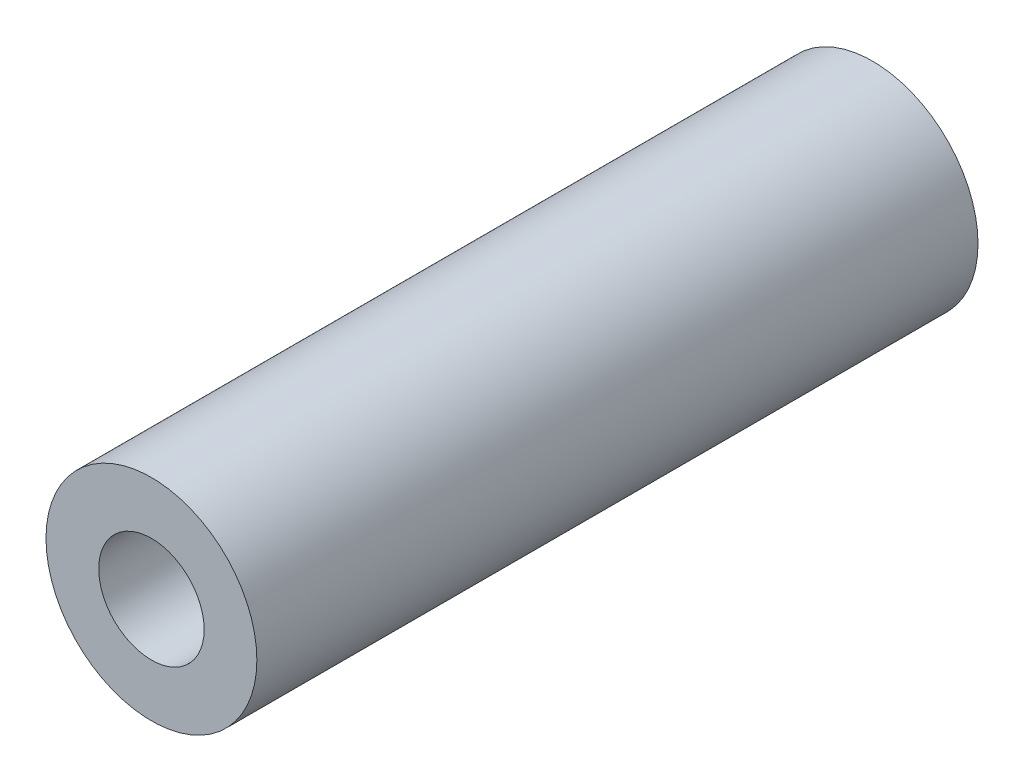
ISO-10303-21;
HEADER;
FILE_DESCRIPTION(('STEP AP214'),'2;1');
FILE_NAME('part.step','',(''),(''),'','','');
FILE_SCHEMA(('AUTOMOTIVE_DESIGN { 1 0 10303 214 1 1 1 1 }'));
ENDSEC;
DATA;
#1=APPLICATION_CONTEXT('core data for automotive mechanical design processes');
#2=APPLICATION_PROTOCOL_DEFINITION('international standard','automotive_design',2000,#1);
#3=PRODUCT_CONTEXT('',#1,'mechanical');
#4=PRODUCT('Part','Part','',(#3));
#5=PRODUCT_RELATED_PRODUCT_CATEGORY('part','',(#4));
#6=PRODUCT_DEFINITION_FORMATION('','',#4);
#7=PRODUCT_DEFINITION_CONTEXT('part definition',#1,'design');
#8=PRODUCT_DEFINITION('design','',#6,#7);
#9=PRODUCT_DEFINITION_SHAPE('','',#8);
#10=(LENGTH_UNIT() NAMED_UNIT(*) SI_UNIT(.MILLI.,.METRE.));
#11=(NAMED_UNIT(*) PLANE_ANGLE_UNIT() SI_UNIT($,.RADIAN.));
#12=(NAMED_UNIT(*) SI_UNIT($,.STERADIAN.) SOLID_ANGLE_UNIT());
#13=UNCERTAINTY_MEASURE_WITH_UNIT(LENGTH_MEASURE(1.E-05),#10,'distance_accuracy_value','');
#14=(GEOMETRIC_REPRESENTATION_CONTEXT(3) GLOBAL_UNCERTAINTY_ASSIGNED_CONTEXT((#13)) GLOBAL_UNIT_ASSIGNED_CONTEXT((#10,
#11,#12)) REPRESENTATION_CONTEXT('',''));
#15=CARTESIAN_POINT('',(0.,0.,0.));
#16=DIRECTION('',(0.,0.,1.));
#17=DIRECTION('',(1.,0.,0.));
#18=AXIS2_PLACEMENT_3D('',#15,#16,#17);
#19=CARTESIAN_POINT('',(0.,0.,43.434));
#20=DIRECTION('',(0.,0.,1.));
#21=DIRECTION('',(1.,0.,0.));
#22=AXIS2_PLACEMENT_3D('',#19,#20,#21);
#23=PLANE('',#22);
#24=CARTESIAN_POINT('',(0.,0.,43.434));
#25=DIRECTION('',(0.,0.,1.));
#26=DIRECTION('',(1.,0.,0.));
#27=AXIS2_PLACEMENT_3D('',#24,#25,#26);
#28=CIRCLE('',#27,6.35);
#29=CARTESIAN_POINT('',(6.35,0.,43.434));
#30=VERTEX_POINT('',#29);
#31=EDGE_CURVE('E10',#30,#30,#28,.T.);
#32=ORIENTED_EDGE('',*,*,#31,.T.);
#33=EDGE_LOOP('',(#32));
#34=FACE_BOUND('',#33,.T.);
#35=CARTESIAN_POINT('',(0.,0.,43.434));
#36=DIRECTION('',(0.,0.,1.));
#37=DIRECTION('',(1.,0.,0.));
#38=AXIS2_PLACEMENT_3D('',#35,#36,#37);
#39=CIRCLE('',#38,3.175);
#40=CARTESIAN_POINT('',(3.175,0.,43.434));
#41=VERTEX_POINT('',#40);
#42=EDGE_CURVE('E41',#41,#41,#39,.T.);
#43=ORIENTED_EDGE('',*,*,#42,.F.);
#44=EDGE_LOOP('',(#43));
#45=FACE_BOUND('',#44,.T.);
#46=ADVANCED_FACE('F30',(#34,#45),#23,.T.);
#47=CARTESIAN_POINT('',(0.,0.,0.));
#48=DIRECTION('',(0.,0.,1.));
#49=DIRECTION('',(1.,0.,0.));
#50=AXIS2_PLACEMENT_3D('',#47,#48,#49);
#51=PLANE('',#50);
#52=CARTESIAN_POINT('',(0.,0.,0.));
#53=DIRECTION('',(0.,0.,1.));
#54=DIRECTION('',(1.,0.,0.));
#55=AXIS2_PLACEMENT_3D('',#52,#53,#54);
#56=CIRCLE('',#55,6.35);
#57=CARTESIAN_POINT('',(6.35,0.,0.));
#58=VERTEX_POINT('',#57);
#59=EDGE_CURVE('E34',#58,#58,#56,.T.);
#60=ORIENTED_EDGE('',*,*,#59,.F.);
#61=EDGE_LOOP('',(#60));
#62=FACE_BOUND('',#61,.T.);
#63=CARTESIAN_POINT('',(0.,0.,0.));
#64=DIRECTION('',(0.,0.,1.));
#65=DIRECTION('',(1.,0.,0.));
#66=AXIS2_PLACEMENT_3D('',#63,#64,#65);
#67=CIRCLE('',#66,3.175);
#68=CARTESIAN_POINT('',(3.175,0.,0.));
#69=VERTEX_POINT('',#68);
#70=EDGE_CURVE('E43',#69,#69,#67,.T.);
#71=ORIENTED_EDGE('',*,*,#70,.T.);
#72=EDGE_LOOP('',(#71));
#73=FACE_BOUND('',#72,.T.);
#74=ADVANCED_FACE('F53',(#62,#73),#51,.F.);
#75=CARTESIAN_POINT('',(0.,0.,43.434));
#76=DIRECTION('',(0.,0.,-1.));
#77=DIRECTION('',(-1.,0.,0.));
#78=AXIS2_PLACEMENT_3D('',#75,#76,#77);
#79=CYLINDRICAL_SURFACE('',#78,6.35);
#80=ORIENTED_EDGE('',*,*,#31,.F.);
#81=EDGE_LOOP('',(#80));
#82=FACE_BOUND('',#81,.T.);
#83=ORIENTED_EDGE('',*,*,#59,.T.);
#84=EDGE_LOOP('',(#83));
#85=FACE_BOUND('',#84,.T.);
#86=ADVANCED_FACE('F32',(#82,#85),#79,.T.);
#87=CARTESIAN_POINT('',(0.,0.,43.434));
#88=DIRECTION('',(0.,0.,-1.));
#89=DIRECTION('',(-1.,0.,0.));
#90=AXIS2_PLACEMENT_3D('',#87,#88,#89);
#91=CYLINDRICAL_SURFACE('',#90,3.175);
#92=ORIENTED_EDGE('',*,*,#42,.T.);
#93=EDGE_LOOP('',(#92));
#94=FACE_BOUND('',#93,.T.);
#95=ORIENTED_EDGE('',*,*,#70,.F.);
#96=EDGE_LOOP('',(#95));
#97=FACE_BOUND('',#96,.T.);
#98=ADVANCED_FACE('F49',(#94,#97),#91,.F.);
#99=CLOSED_SHELL('',(#46,#74,#86,#98));
#100=MANIFOLD_SOLID_BREP('B2',#99);
#101=ADVANCED_BREP_SHAPE_REPRESENTATION('',(#18,#100),#14);
#102=SHAPE_DEFINITION_REPRESENTATION(#9,#101);
ENDSEC;
END-ISO-10303-21;
